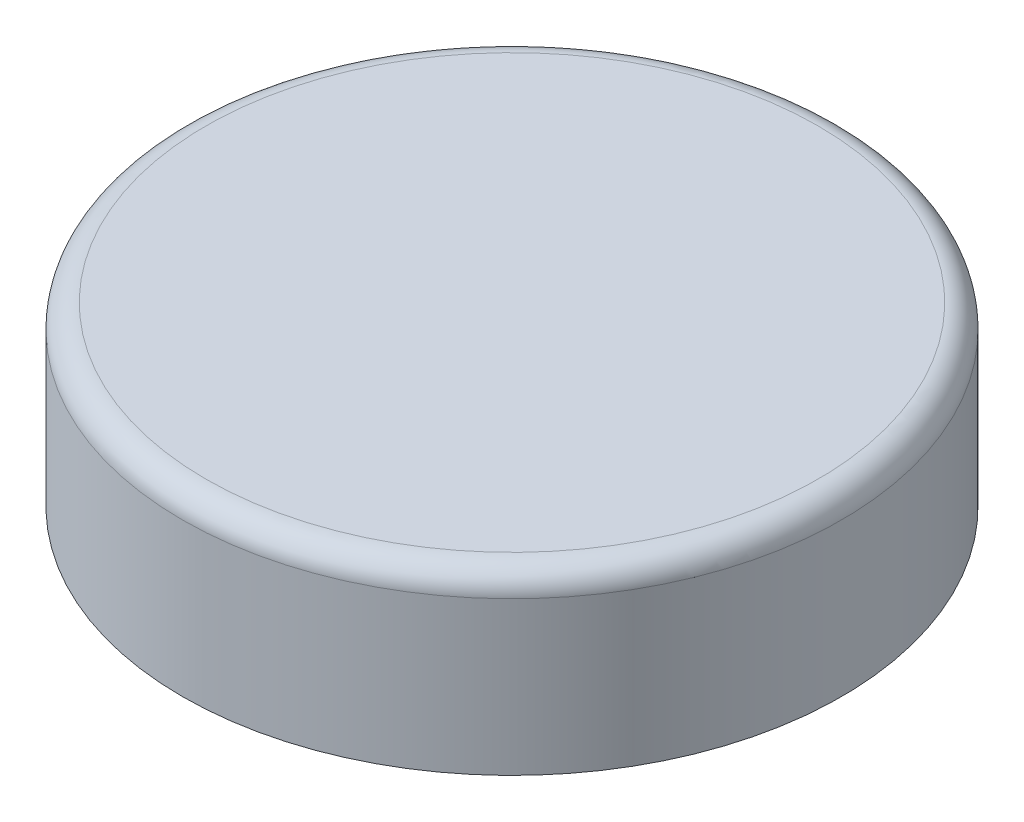
ISO-10303-21;
HEADER;
FILE_DESCRIPTION(('STEP AP214'),'2;1');
FILE_NAME('part.step','',(''),(''),'','','');
FILE_SCHEMA(('AUTOMOTIVE_DESIGN { 1 0 10303 214 1 1 1 1 }'));
ENDSEC;
DATA;
#1=APPLICATION_CONTEXT('core data for automotive mechanical design processes');
#2=APPLICATION_PROTOCOL_DEFINITION('international standard','automotive_design',2000,#1);
#3=PRODUCT_CONTEXT('',#1,'mechanical');
#4=PRODUCT('Part','Part','',(#3));
#5=PRODUCT_RELATED_PRODUCT_CATEGORY('part','',(#4));
#6=PRODUCT_DEFINITION_FORMATION('','',#4);
#7=PRODUCT_DEFINITION_CONTEXT('part definition',#1,'design');
#8=PRODUCT_DEFINITION('design','',#6,#7);
#9=PRODUCT_DEFINITION_SHAPE('','',#8);
#10=(LENGTH_UNIT() NAMED_UNIT(*) SI_UNIT(.MILLI.,.METRE.));
#11=(NAMED_UNIT(*) PLANE_ANGLE_UNIT() SI_UNIT($,.RADIAN.));
#12=(NAMED_UNIT(*) SI_UNIT($,.STERADIAN.) SOLID_ANGLE_UNIT());
#13=UNCERTAINTY_MEASURE_WITH_UNIT(LENGTH_MEASURE(1.E-05),#10,'distance_accuracy_value','');
#14=(GEOMETRIC_REPRESENTATION_CONTEXT(3) GLOBAL_UNCERTAINTY_ASSIGNED_CONTEXT((#13)) GLOBAL_UNIT_ASSIGNED_CONTEXT((#10,
#11,#12)) REPRESENTATION_CONTEXT('',''));
#15=CARTESIAN_POINT('',(0.,0.,0.));
#16=DIRECTION('',(0.,0.,1.));
#17=DIRECTION('',(1.,0.,0.));
#18=AXIS2_PLACEMENT_3D('',#15,#16,#17);
#19=CARTESIAN_POINT('',(0.,15.,0.));
#20=DIRECTION('',(0.,-1.,0.));
#21=DIRECTION('',(0.,0.,-1.));
#22=AXIS2_PLACEMENT_3D('',#19,#20,#21);
#23=CYLINDRICAL_SURFACE('',#22,25.);
#24=CARTESIAN_POINT('',(0.,0.,0.));
#25=DIRECTION('',(0.,1.,0.));
#26=DIRECTION('',(0.,0.,1.));
#27=AXIS2_PLACEMENT_3D('',#24,#25,#26);
#28=CIRCLE('',#27,25.);
#29=CARTESIAN_POINT('',(0.,0.,25.));
#30=VERTEX_POINT('',#29);
#31=EDGE_CURVE('E50',#30,#30,#28,.T.);
#32=ORIENTED_EDGE('',*,*,#31,.F.);
#33=EDGE_LOOP('',(#32));
#34=FACE_BOUND('',#33,.T.);
#35=CARTESIAN_POINT('',(0.,13.5,0.));
#36=DIRECTION('',(0.,1.,0.));
#37=DIRECTION('',(0.,0.,1.));
#38=AXIS2_PLACEMENT_3D('',#35,#36,#37);
#39=CIRCLE('',#38,25.);
#40=CARTESIAN_POINT('',(0.,13.5,25.));
#41=VERTEX_POINT('',#40);
#42=EDGE_CURVE('E53',#41,#41,#39,.T.);
#43=ORIENTED_EDGE('',*,*,#42,.T.);
#44=EDGE_LOOP('',(#43));
#45=FACE_BOUND('',#44,.T.);
#46=ADVANCED_FACE('F35',(#34,#45),#23,.F.);
#47=CARTESIAN_POINT('',(0.,15.,0.));
#48=DIRECTION('',(0.,1.,0.));
#49=DIRECTION('',(0.,0.,1.));
#50=AXIS2_PLACEMENT_3D('',#47,#48,#49);
#51=PLANE('',#50);
#52=CARTESIAN_POINT('',(0.,15.,0.));
#53=DIRECTION('',(0.,1.,0.));
#54=DIRECTION('',(0.,0.,1.));
#55=AXIS2_PLACEMENT_3D('',#52,#53,#54);
#56=CIRCLE('',#55,26.);
#57=CARTESIAN_POINT('',(0.,15.,26.));
#58=VERTEX_POINT('',#57);
#59=EDGE_CURVE('E42',#58,#58,#56,.T.);
#60=ORIENTED_EDGE('',*,*,#59,.T.);
#61=EDGE_LOOP('',(#60));
#62=FACE_BOUND('',#61,.T.);
#63=ADVANCED_FACE('F63',(#62),#51,.T.);
#64=CARTESIAN_POINT('',(0.,0.,0.));
#65=DIRECTION('',(0.,1.,0.));
#66=DIRECTION('',(0.,0.,1.));
#67=AXIS2_PLACEMENT_3D('',#64,#65,#66);
#68=PLANE('',#67);
#69=CARTESIAN_POINT('',(0.,0.,0.));
#70=DIRECTION('',(0.,1.,0.));
#71=DIRECTION('',(0.,0.,1.));
#72=AXIS2_PLACEMENT_3D('',#69,#70,#71);
#73=CIRCLE('',#72,28.);
#74=CARTESIAN_POINT('',(0.,0.,28.));
#75=VERTEX_POINT('',#74);
#76=EDGE_CURVE('E46',#75,#75,#73,.T.);
#77=ORIENTED_EDGE('',*,*,#76,.F.);
#78=EDGE_LOOP('',(#77));
#79=FACE_BOUND('',#78,.T.);
#80=ORIENTED_EDGE('',*,*,#31,.T.);
#81=EDGE_LOOP('',(#80));
#82=FACE_BOUND('',#81,.T.);
#83=ADVANCED_FACE('F59',(#79,#82),#68,.F.);
#84=CARTESIAN_POINT('',(0.,15.,0.));
#85=DIRECTION('',(0.,-1.,0.));
#86=DIRECTION('',(0.,0.,-1.));
#87=AXIS2_PLACEMENT_3D('',#84,#85,#86);
#88=CYLINDRICAL_SURFACE('',#87,28.);
#89=CARTESIAN_POINT('',(0.,13.,0.));
#90=DIRECTION('',(0.,1.,0.));
#91=DIRECTION('',(0.,0.,1.));
#92=AXIS2_PLACEMENT_3D('',#89,#90,#91);
#93=CIRCLE('',#92,28.);
#94=CARTESIAN_POINT('',(0.,13.,28.));
#95=VERTEX_POINT('',#94);
#96=EDGE_CURVE('E10',#95,#95,#93,.F.);
#97=ORIENTED_EDGE('',*,*,#96,.T.);
#98=EDGE_LOOP('',(#97));
#99=FACE_BOUND('',#98,.T.);
#100=ORIENTED_EDGE('',*,*,#76,.T.);
#101=EDGE_LOOP('',(#100));
#102=FACE_BOUND('',#101,.T.);
#103=ADVANCED_FACE('F69',(#99,#102),#88,.T.);
#104=CARTESIAN_POINT('',(0.,13.5,0.));
#105=DIRECTION('',(0.,1.,0.));
#106=DIRECTION('',(0.,0.,1.));
#107=AXIS2_PLACEMENT_3D('',#104,#105,#106);
#108=PLANE('',#107);
#109=ORIENTED_EDGE('',*,*,#42,.F.);
#110=EDGE_LOOP('',(#109));
#111=FACE_BOUND('',#110,.T.);
#112=ADVANCED_FACE('F67',(#111),#108,.F.);
#113=CARTESIAN_POINT('',(0.,13.,0.));
#114=DIRECTION('',(0.,1.,0.));
#115=DIRECTION('',(0.,0.,1.));
#116=AXIS2_PLACEMENT_3D('',#113,#114,#115);
#117=TOROIDAL_SURFACE('',#116,26.,2.);
#118=ORIENTED_EDGE('',*,*,#96,.F.);
#119=EDGE_LOOP('',(#118));
#120=FACE_BOUND('',#119,.T.);
#121=ORIENTED_EDGE('',*,*,#59,.F.);
#122=EDGE_LOOP('',(#121));
#123=FACE_BOUND('',#122,.T.);
#124=ADVANCED_FACE('F37',(#120,#123),#117,.T.);
#125=CLOSED_SHELL('',(#46,#63,#83,#103,#112,#124));
#126=MANIFOLD_SOLID_BREP('B2',#125);
#127=ADVANCED_BREP_SHAPE_REPRESENTATION('',(#18,#126),#14);
#128=SHAPE_DEFINITION_REPRESENTATION(#9,#127);
ENDSEC;
END-ISO-10303-21;
